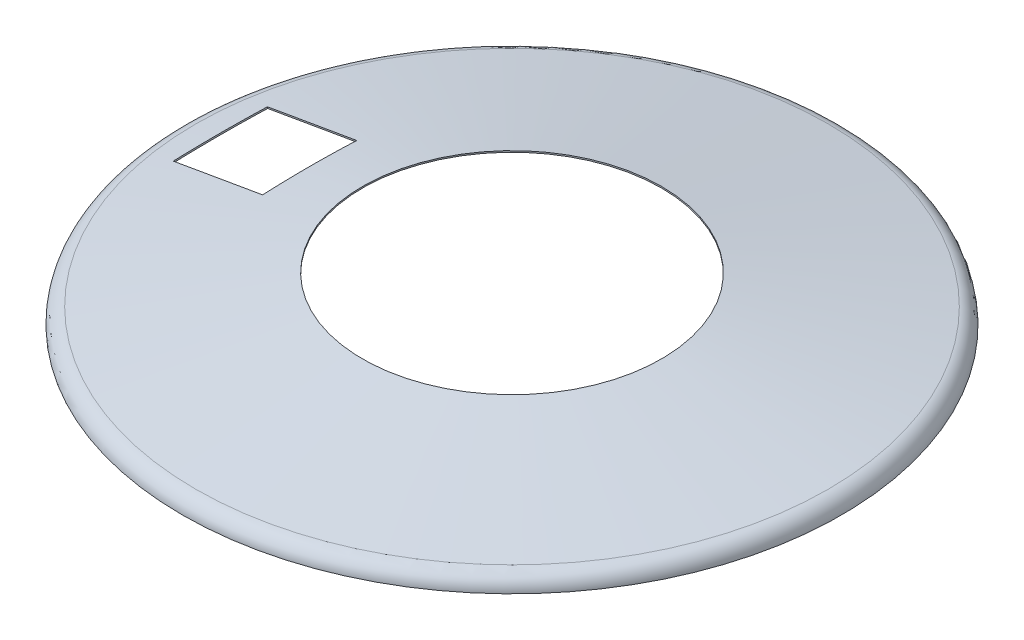
ISO-10303-21;
HEADER;
FILE_DESCRIPTION(('STEP AP214'),'2;1');
FILE_NAME('part.step','',(''),(''),'','','');
FILE_SCHEMA(('AUTOMOTIVE_DESIGN { 1 0 10303 214 1 1 1 1 }'));
ENDSEC;
DATA;
#1=APPLICATION_CONTEXT('core data for automotive mechanical design processes');
#2=APPLICATION_PROTOCOL_DEFINITION('international standard','automotive_design',2000,#1);
#3=PRODUCT_CONTEXT('',#1,'mechanical');
#4=PRODUCT('Part','Part','',(#3));
#5=PRODUCT_RELATED_PRODUCT_CATEGORY('part','',(#4));
#6=PRODUCT_DEFINITION_FORMATION('','',#4);
#7=PRODUCT_DEFINITION_CONTEXT('part definition',#1,'design');
#8=PRODUCT_DEFINITION('design','',#6,#7);
#9=PRODUCT_DEFINITION_SHAPE('','',#8);
#10=(LENGTH_UNIT() NAMED_UNIT(*) SI_UNIT(.MILLI.,.METRE.));
#11=(NAMED_UNIT(*) PLANE_ANGLE_UNIT() SI_UNIT($,.RADIAN.));
#12=(NAMED_UNIT(*) SI_UNIT($,.STERADIAN.) SOLID_ANGLE_UNIT());
#13=UNCERTAINTY_MEASURE_WITH_UNIT(LENGTH_MEASURE(1.E-05),#10,'distance_accuracy_value','');
#14=(GEOMETRIC_REPRESENTATION_CONTEXT(3) GLOBAL_UNCERTAINTY_ASSIGNED_CONTEXT((#13)) GLOBAL_UNIT_ASSIGNED_CONTEXT((#10,
#11,#12)) REPRESENTATION_CONTEXT('',''));
#15=CARTESIAN_POINT('',(0.,0.,0.));
#16=DIRECTION('',(0.,0.,1.));
#17=DIRECTION('',(1.,0.,0.));
#18=AXIS2_PLACEMENT_3D('',#15,#16,#17);
#19=CARTESIAN_POINT('',(-115.932209913367,-471.078681033964,-95.5));
#20=DIRECTION('',(-0.866025403784441,-0.499999999999997,0.));
#21=DIRECTION('',(0.499999999999997,-0.866025403784441,0.));
#22=AXIS2_PLACEMENT_3D('',#19,#20,#21);
#23=PLANE('',#22);
#24=DIRECTION('',(0.,0.,1.));
#25=VECTOR('',#24,1.);
#26=CARTESIAN_POINT('',(-429.331249918757,71.7443792986884,-95.4999999999998));
#27=LINE('',#26,#25);
#28=CARTESIAN_POINT('',(-429.331249918757,71.7443792986884,-95.5));
#29=VERTEX_POINT('',#28);
#30=CARTESIAN_POINT('',(-429.331249918757,71.7443792986879,-82.8285987390821));
#31=VERTEX_POINT('',#30);
#32=EDGE_CURVE('E260',#29,#31,#27,.T.);
#33=ORIENTED_EDGE('',*,*,#32,.F.);
#34=DIRECTION('',(-0.499999999999997,0.866025403784441,0.));
#35=VECTOR('',#34,1.);
#36=CARTESIAN_POINT('',(-115.932209913367,-471.078681033964,-95.5));
#37=LINE('',#36,#35);
#38=CARTESIAN_POINT('',(-429.093038378936,71.331784808768,-95.5));
#39=VERTEX_POINT('',#38);
#40=EDGE_CURVE('E198',#39,#29,#37,.T.);
#41=ORIENTED_EDGE('',*,*,#40,.F.);
#42=CARTESIAN_POINT('',(-429.093034361608,71.3317778505521,95.5002));
#43=CARTESIAN_POINT('',(-429.172938291337,71.4701755165674,91.5223369563016));
#44=CARTESIAN_POINT('',(-429.24804641461,71.6002666021375,87.5440941889164));
#45=CARTESIAN_POINT('',(-429.388542216467,71.8436124692038,79.5869194245034));
#46=CARTESIAN_POINT('',(-429.453929887922,71.9568672383519,75.6079874269721));
#47=CARTESIAN_POINT('',(-429.635318930964,72.2710422768383,63.67026378774));
#48=CARTESIAN_POINT('',(-429.736546172461,72.4463730022201,55.7105523783634));
#49=CARTESIAN_POINT('',(-429.898782990876,72.7273754145727,39.7927774625099));
#50=CARTESIAN_POINT('',(-429.959809103711,72.8330757425914,31.8347146261831));
#51=CARTESIAN_POINT('',(-430.041231391494,72.9741032819,15.9177678587885));
#52=CARTESIAN_POINT('',(-430.061627647684,73.0094306339052,7.95888392939424));
#53=CARTESIAN_POINT('',(-430.061627647684,73.0094306339052,-7.95888392939421));
#54=CARTESIAN_POINT('',(-430.041231391494,72.9741032819,-15.9177678587884));
#55=CARTESIAN_POINT('',(-429.959809103711,72.8330757425914,-31.8347146261831));
#56=CARTESIAN_POINT('',(-429.898782990876,72.7273754145727,-39.7927774625099));
#57=CARTESIAN_POINT('',(-429.736546172461,72.4463730022201,-55.7105523783634));
#58=CARTESIAN_POINT('',(-429.635318930964,72.2710422768383,-63.67026378774));
#59=CARTESIAN_POINT('',(-429.453929887922,71.9568672383519,-75.6079874269721));
#60=CARTESIAN_POINT('',(-429.388542216467,71.8436124692039,-79.5869194245033));
#61=CARTESIAN_POINT('',(-429.24804641461,71.6002666021375,-87.5440941889164));
#62=CARTESIAN_POINT('',(-429.172938291337,71.4701755165674,-91.5223369563015));
#63=CARTESIAN_POINT('',(-429.093034361608,71.3317778505521,-95.5002));
#64=B_SPLINE_CURVE_WITH_KNOTS('',3,(#42,#43,#44,#45,#46,#47,#48,#49,#50,#51,#52,#53,#54,#55,#56,
#57,#58,#59,#60,#61,#62,#63),.UNSPECIFIED.,.F.,.F.,(4,2,2,2,2,2,2,2,2,2,4),(0.,11.9431919910017,
23.8863927413458,47.7728178970725,71.6494117124264,95.525957784919,119.402503857412,
143.279097672766,167.165522828492,179.108723578836,191.051915569838),.UNSPECIFIED.);
#65=EDGE_CURVE('E224',#31,#39,#64,.T.);
#66=ORIENTED_EDGE('',*,*,#65,.F.);
#67=EDGE_LOOP('',(#33,#41,#66));
#68=FACE_BOUND('',#67,.T.);
#69=ADVANCED_FACE('F51',(#68),#23,.T.);
#70=CARTESIAN_POINT('',(0.,150.,0.));
#71=DIRECTION('',(0.,-1.,0.));
#72=DIRECTION('',(0.,0.,-1.));
#73=AXIS2_PLACEMENT_3D('',#70,#71,#72);
#74=CONICAL_SURFACE('',#73,9.99999999999999,1.39654914535002);
#75=CARTESIAN_POINT('',(-950.370325256532,-16.4591906197073,99.9999999999998));
#76=CARTESIAN_POINT('',(-935.523594358654,-13.8600421184706,99.9999999999997));
#77=CARTESIAN_POINT('',(-920.67675268677,-11.2615262310917,99.9999999999997));
#78=CARTESIAN_POINT('',(-890.982807568639,-6.06599029186537,99.9999999999997));
#79=CARTESIAN_POINT('',(-876.135704122393,-3.46897024002299,99.9999999999997));
#80=CARTESIAN_POINT('',(-846.441205444463,1.72334163407172,99.9999999999997));
#81=CARTESIAN_POINT('',(-831.593810212985,4.3186334575,99.9999999999997));
#82=CARTESIAN_POINT('',(-801.898666345928,9.50719470137558,99.9999999999997));
#83=CARTESIAN_POINT('',(-787.050917710349,12.1004641218202,99.9999999999997));
#84=CARTESIAN_POINT('',(-757.355070604999,17.2846059152811,99.9999999999997));
#85=CARTESIAN_POINT('',(-742.506972137096,19.8754782990004,99.9999999999997));
#86=CARTESIAN_POINT('',(-712.810279689154,25.0543816669291,99.9999999999997));
#87=CARTESIAN_POINT('',(-697.961685709116,27.6424126511463,99.9999999999997));
#88=CARTESIAN_POINT('',(-668.263890978151,32.815056165516,99.9999999999997));
#89=CARTESIAN_POINT('',(-653.414690226783,35.3996686931406,99.9999999999997));
#90=CARTESIAN_POINT('',(-623.715564140523,40.5647270119882,99.9999999999997));
#91=CARTESIAN_POINT('',(-608.865638805639,43.1451728032517,99.9999999999997));
#92=CARTESIAN_POINT('',(-579.164786980389,48.3009376619514,99.9999999999997));
#93=CARTESIAN_POINT('',(-564.313860483537,50.8762566920242,99.9999999999997));
#94=CARTESIAN_POINT('',(-534.610891259595,56.0204429856048,99.9999999999997));
#95=CARTESIAN_POINT('',(-519.758848532608,58.5893102496992,99.9999999999997));
#96=CARTESIAN_POINT('',(-490.053366275933,63.7187998953491,99.9999999999997));
#97=CARTESIAN_POINT('',(-475.199926748776,66.2794222915534,99.9999999999997));
#98=CARTESIAN_POINT('',(-445.491196913222,71.3899455324338,99.9999999999997));
#99=CARTESIAN_POINT('',(-430.635906604184,73.9398463733878,99.9999999999997));
#100=CARTESIAN_POINT('',(-408.351074172993,77.7539204184719,99.9999999999997));
#101=CARTESIAN_POINT('',(-400.922455031503,79.0234865702625,99.9999999999997));
#102=CARTESIAN_POINT('',(-386.064496092451,81.5583946610527,99.9999999999997));
#103=CARTESIAN_POINT('',(-378.635156294909,82.8237366001622,99.9999999999997));
#104=CARTESIAN_POINT('',(-363.77563888018,85.3494490384255,99.9999999999997));
#105=CARTESIAN_POINT('',(-356.345461263806,86.6098195423671,99.9999999999997));
#106=CARTESIAN_POINT('',(-341.484105195661,89.1246527737558,99.9999999999997));
#107=CARTESIAN_POINT('',(-334.052926743783,90.3791155005783,99.9999999999997));
#108=CARTESIAN_POINT('',(-319.189330088498,92.8809584854959,99.9999999999997));
#109=CARTESIAN_POINT('',(-311.756911877702,94.1283386997053,99.9999999999997));
#110=CARTESIAN_POINT('',(-296.890639441912,96.614504410786,99.9999999999997));
#111=CARTESIAN_POINT('',(-289.456785217367,97.8532899103432,99.9999999999997));
#112=CARTESIAN_POINT('',(-278.304676790716,99.7035447773387,99.9999999999997));
#113=CARTESIAN_POINT('',(-274.587079913374,100.318976858855,99.9999999999997));
#114=CARTESIAN_POINT('',(-267.151399074549,101.546890636013,99.9999999999997));
#115=CARTESIAN_POINT('',(-263.433315113097,102.159372331847,99.9999999999997));
#116=CARTESIAN_POINT('',(-255.996602576377,103.38104572185,99.9999999999997));
#117=CARTESIAN_POINT('',(-252.277974000545,103.990237412586,99.9999999999997));
#118=CARTESIAN_POINT('',(-244.840111078716,105.204916435165,99.9999999999997));
#119=CARTESIAN_POINT('',(-241.120876732579,105.810403766154,99.9999999999997));
#120=CARTESIAN_POINT('',(-237.40130784213,106.413831920006,99.9999999999997));
#121=B_SPLINE_CURVE_WITH_KNOTS('',3,(#75,#76,#77,#78,#79,#80,#81,#82,#83,#84,#85,#86,#87,#88,
#89,#90,#91,#92,#93,#94,#95,#96,#97,#98,#99,#100,#101,#102,#103,#104,#105,#106,#107,#108,#109,
#110,#111,#112,#113,#114,#115,#116,#117,#118,#119,#120),.UNSPECIFIED.,.F.,.F.,(4,2,2,2,2,2,2,2,
2,2,2,2,2,2,2,2,2,2,2,2,2,2,4),(0.,45.2175731732453,90.4351465022107,135.65268903182,
180.870231620516,226.087571321884,271.304910897883,316.522283892614,361.73965644702,
406.957357343216,452.175054127646,497.392670528604,542.610302626311,565.219273893365,
587.828244571841,610.437193471716,633.04614476215,655.655235992778,678.264320157314,
689.568900061745,700.873479223093,712.178070177561,723.482663740328),.UNSPECIFIED.);
#122=CARTESIAN_POINT('',(-619.532326658648,41.2910288354882,99.9999999999997));
#123=VERTEX_POINT('',#122);
#124=CARTESIAN_POINT('',(-429.744212308655,74.0903250776291,99.9999999999998));
#125=VERTEX_POINT('',#124);
#126=EDGE_CURVE('E137',#123,#125,#121,.T.);
#127=ORIENTED_EDGE('',*,*,#126,.F.);
#128=CARTESIAN_POINT('',(-619.532325700396,41.2910233918736,-100.0002));
#129=CARTESIAN_POINT('',(-619.572254470877,41.5178496909786,-91.6681660032065));
#130=CARTESIAN_POINT('',(-619.607301655845,41.7169448087163,-83.3353480656244));
#131=CARTESIAN_POINT('',(-619.667505680389,42.058950232721,-66.6685140375956));
#132=CARTESIAN_POINT('',(-619.692662507704,42.2018604693314,-58.3344979456762));
#133=CARTESIAN_POINT('',(-619.732954648105,42.4307509906246,-41.667269137553));
#134=CARTESIAN_POINT('',(-619.748091897524,42.5167422751755,-33.3340565774838));
#135=CARTESIAN_POINT('',(-619.768283220978,42.6314446093051,-16.6672293447888));
#136=CARTESIAN_POINT('',(-619.77333730075,42.660155691467,-8.33361467239445));
#137=CARTESIAN_POINT('',(-619.77333730075,42.660155691467,8.33361467239421));
#138=CARTESIAN_POINT('',(-619.768283220978,42.6314446093051,16.6672293447886));
#139=CARTESIAN_POINT('',(-619.748091897524,42.5167422751755,33.3340565774835));
#140=CARTESIAN_POINT('',(-619.732954648105,42.4307509906246,41.6672691375527));
#141=CARTESIAN_POINT('',(-619.692662507704,42.2018604693313,58.334497945676));
#142=CARTESIAN_POINT('',(-619.667505680389,42.058950232721,66.6685140375954));
#143=CARTESIAN_POINT('',(-619.607301655845,41.7169448087163,83.3353480656242));
#144=CARTESIAN_POINT('',(-619.572254470877,41.5178496909786,91.6681660032062));
#145=CARTESIAN_POINT('',(-619.532325700396,41.2910233918736,100.0002));
#146=B_SPLINE_CURVE_WITH_KNOTS('',3,(#128,#129,#130,#131,#132,#133,#134,#135,#136,#137,#138,
#139,#140,#141,#142,#143,#144,#145),.UNSPECIFIED.,.F.,.F.,(4,2,2,2,2,2,2,2,4),(0.,
25.0056104066725,50.0112518145787,75.0120593470569,100.012852658073,125.013645969089,
150.014453501567,175.020094909473,200.025705316146),.UNSPECIFIED.);
#147=CARTESIAN_POINT('',(-619.532326658648,41.2910288354881,-100.));
#148=VERTEX_POINT('',#147);
#149=EDGE_CURVE('E71',#148,#123,#146,.T.);
#150=ORIENTED_EDGE('',*,*,#149,.F.);
#151=CARTESIAN_POINT('',(-237.40130784213,106.413831920006,-100.));
#152=CARTESIAN_POINT('',(-242.739375542503,105.547803955144,-100.));
#153=CARTESIAN_POINT('',(-248.076760557433,104.677579132615,-100.));
#154=CARTESIAN_POINT('',(-258.750338276316,102.929864226002,-100.));
#155=CARTESIAN_POINT('',(-264.086530980908,102.05237414582,-100.));
#156=CARTESIAN_POINT('',(-274.75789221902,100.291258003178,-100.));
#157=CARTESIAN_POINT('',(-280.093060754565,99.4076319529752,-100.));
#158=CARTESIAN_POINT('',(-290.762520920713,97.6350980357732,-100.));
#159=CARTESIAN_POINT('',(-296.096812551181,96.7461901679578,-100.));
#160=CARTESIAN_POINT('',(-312.098500049394,94.0726729138723,-100.));
#161=CARTESIAN_POINT('',(-322.764759524678,92.2812614450178,-100.));
#162=CARTESIAN_POINT('',(-344.094967595146,88.6847089671003,-100.));
#163=CARTESIAN_POINT('',(-354.758916188943,86.8795679498211,-100.));
#164=CARTESIAN_POINT('',(-376.084928978274,83.2586320639311,-100.));
#165=CARTESIAN_POINT('',(-386.746993186167,81.4428372680832,-100.));
#166=CARTESIAN_POINT('',(-408.06968031832,77.8028215376579,-100.));
#167=CARTESIAN_POINT('',(-418.730303242878,75.9786006048244,-100.));
#168=CARTESIAN_POINT('',(-440.050400473227,72.323386935144,-100.));
#169=CARTESIAN_POINT('',(-450.709874777676,70.4923941904832,-100.));
#170=CARTESIAN_POINT('',(-472.027874942412,66.8248944125679,-100.));
#171=CARTESIAN_POINT('',(-482.686400802662,64.9883873791087,-100.));
#172=CARTESIAN_POINT('',(-501.734575741535,61.7021211155233,-100.));
#173=CARTESIAN_POINT('',(-510.124374198799,60.2532275448342,-100.));
#174=CARTESIAN_POINT('',(-526.903545661544,57.3529944552242,-100.));
#175=CARTESIAN_POINT('',(-535.292918667155,55.9016549370556,-100.));
#176=CARTESIAN_POINT('',(-552.071306373218,52.996842636189,-100.));
#177=CARTESIAN_POINT('',(-560.460321073199,51.5433698507653,-100.));
#178=CARTESIAN_POINT('',(-577.238027022341,48.6345540456257,-100.));
#179=CARTESIAN_POINT('',(-585.626718271472,47.1792110257321,-100.));
#180=CARTESIAN_POINT('',(-608.865698021583,43.1451648092799,-100.));
#181=CARTESIAN_POINT('',(-623.715681973158,40.5647071488846,-100.));
#182=CARTESIAN_POINT('',(-653.414925640985,35.3996271221068,-100.));
#183=CARTESIAN_POINT('',(-668.264185357228,32.8150047556743,-99.9999999999999));
#184=CARTESIAN_POINT('',(-697.962109271412,27.6423390128333,-99.9999999999999));
#185=CARTESIAN_POINT('',(-712.810773469337,25.0542956363399,-99.9999999999999));
#186=CARTESIAN_POINT('',(-742.507606374732,19.8753676108863,-99.9999999999999));
#187=CARTESIAN_POINT('',(-757.355775082201,17.2844829619177,-99.9999999999999));
#188=CARTESIAN_POINT('',(-787.051633916877,12.1003390585649,-99.9999999999999));
#189=CARTESIAN_POINT('',(-801.899324045826,9.50707981416077,-99.9999999999999));
#190=CARTESIAN_POINT('',(-831.594350961211,4.31853894276885,-99.9999999999999));
#191=CARTESIAN_POINT('',(-846.441687747647,1.72325731577604,-99.9999999999999));
#192=CARTESIAN_POINT('',(-876.136057364412,-3.46903202327144,-99.9999999999999));
#193=CARTESIAN_POINT('',(-890.983090194783,-6.06603973508652,-99.9999999999999));
#194=CARTESIAN_POINT('',(-920.676894026541,-11.2615509689308,-99.9999999999999));
#195=CARTESIAN_POINT('',(-935.523665027931,-13.8600544909492,-99.9999999999999));
#196=CARTESIAN_POINT('',(-950.370325256532,-16.4591906197073,-99.9999999999999));
#197=B_SPLINE_CURVE_WITH_KNOTS('',3,(#151,#152,#153,#154,#155,#156,#157,#158,#159,#160,#161,
#162,#163,#164,#165,#166,#167,#168,#169,#170,#171,#172,#173,#174,#175,#176,#177,#178,#179,#180,
#181,#182,#183,#184,#185,#186,#187,#188,#189,#190,#191,#192,#193,#194,#195,#196),.UNSPECIFIED.,
.F.,.F.,(4,2,2,2,2,2,2,2,2,2,2,2,2,2,2,2,2,2,2,2,2,2,4),(0.,16.2235816898107,32.4471546646425,
48.6706952432483,64.8942383297104,97.3411694236918,129.788119936423,162.234849100878,
194.681571550733,227.128331452256,259.575092558265,285.117059538039,310.659018663835,
336.201010455304,361.743004676476,406.96055648815,452.17810884393,497.395662321663,
542.613215932092,587.830580365354,633.047944911645,678.265303182682,723.482661123493),.UNSPECIFIED.);
#198=CARTESIAN_POINT('',(-429.744212308655,74.090325077629,-100.));
#199=VERTEX_POINT('',#198);
#200=EDGE_CURVE('E174',#199,#148,#197,.T.);
#201=ORIENTED_EDGE('',*,*,#200,.F.);
#202=CARTESIAN_POINT('',(-429.744210945199,74.0903173321441,100.0002));
#203=CARTESIAN_POINT('',(-429.772608548535,74.2516376831171,95.8348405333095));
#204=CARTESIAN_POINT('',(-429.799318082273,74.4033684931484,91.6690969987999));
#205=CARTESIAN_POINT('',(-429.849305562918,74.6873360458541,83.3369215932543));
#206=CARTESIAN_POINT('',(-429.872583506841,74.8195727715812,79.1704897216229));
#207=CARTESIAN_POINT('',(-429.915652419914,75.064237509335,70.8370035415221));
#208=CARTESIAN_POINT('',(-429.93544337137,75.1766654208487,66.6699492300015));
#209=CARTESIAN_POINT('',(-429.971492169977,75.3814504787528,58.3353369615978));
#210=CARTESIAN_POINT('',(-429.987750018048,75.4738076303731,54.1677790048461));
#211=CARTESIAN_POINT('',(-430.031151006503,75.720358813137,41.6677909259166));
#212=CARTESIAN_POINT('',(-430.052938854821,75.8441306433233,33.3347188918748));
#213=CARTESIAN_POINT('',(-430.082012976968,76.0092941443925,16.6677645705605));
#214=CARTESIAN_POINT('',(-430.089299285589,76.0506860129314,8.33388228528021));
#215=CARTESIAN_POINT('',(-430.089299285589,76.0506860129314,-8.33388228528047));
#216=CARTESIAN_POINT('',(-430.082012976968,76.0092941443925,-16.6677645705608));
#217=CARTESIAN_POINT('',(-430.052938854821,75.8441306433233,-33.334718891875));
#218=CARTESIAN_POINT('',(-430.031151006503,75.720358813137,-41.6677909259169));
#219=CARTESIAN_POINT('',(-429.987750018048,75.4738076303731,-54.1677790048464));
#220=CARTESIAN_POINT('',(-429.971492169977,75.3814504787528,-58.335336961598));
#221=CARTESIAN_POINT('',(-429.93544337137,75.1766654208487,-66.6699492300017));
#222=CARTESIAN_POINT('',(-429.915652419914,75.064237509335,-70.8370035415223));
#223=CARTESIAN_POINT('',(-429.872583506841,74.8195727715811,-79.1704897216232));
#224=CARTESIAN_POINT('',(-429.849305562918,74.6873360458541,-83.3369215932545));
#225=CARTESIAN_POINT('',(-429.799318082273,74.4033684931484,-91.6690969988002));
#226=CARTESIAN_POINT('',(-429.772608548535,74.2516376831171,-95.8348405333097));
#227=CARTESIAN_POINT('',(-429.744210945199,74.090317332144,-100.0002));
#228=B_SPLINE_CURVE_WITH_KNOTS('',3,(#202,#203,#204,#205,#206,#207,#208,#209,#210,#211,#212,
#213,#214,#215,#216,#217,#218,#219,#220,#221,#222,#223,#224,#225,#226,#227),.UNSPECIFIED.,.F.,
.F.,(4,2,2,2,2,2,2,2,2,2,2,2,4),(0.,12.5057268127826,25.0114644974725,37.5172656364541,
50.0230635167302,75.0246721337525,100.026220763831,125.027769393909,150.029378010931,
162.535175891207,175.040977030189,187.546714714879,200.052441527661),.UNSPECIFIED.);
#229=EDGE_CURVE('E175',#125,#199,#228,.T.);
#230=ORIENTED_EDGE('',*,*,#229,.F.);
#231=EDGE_LOOP('',(#127,#150,#201,#230));
#232=FACE_BOUND('',#231,.T.);
#233=CARTESIAN_POINT('',(0.,33.4851492774349,0.));
#234=DIRECTION('',(0.,1.,0.));
#235=DIRECTION('',(0.,0.,1.));
#236=AXIS2_PLACEMENT_3D('',#233,#234,#235);
#237=CIRCLE('',#236,671.89447010917);
#238=CARTESIAN_POINT('',(0.,33.4851492774349,671.89447010917));
#239=VERTEX_POINT('',#238);
#240=EDGE_CURVE('E214',#239,#239,#237,.T.);
#241=ORIENTED_EDGE('',*,*,#240,.T.);
#242=EDGE_LOOP('',(#241));
#243=FACE_BOUND('',#242,.T.);
#244=CARTESIAN_POINT('',(0.,95.8700469407466,0.));
#245=DIRECTION('',(0.,-1.,0.));
#246=DIRECTION('',(0.,0.,-1.));
#247=AXIS2_PLACEMENT_3D('',#244,#245,#246);
#248=CIRCLE('',#247,317.5);
#249=CARTESIAN_POINT('',(0.,95.8700469407466,-317.5));
#250=VERTEX_POINT('',#249);
#251=EDGE_CURVE('E202',#250,#250,#248,.T.);
#252=ORIENTED_EDGE('',*,*,#251,.T.);
#253=EDGE_LOOP('',(#252));
#254=FACE_BOUND('',#253,.T.);
#255=ADVANCED_FACE('F184',(#232,#243,#254),#74,.T.);
#256=CARTESIAN_POINT('',(0.,30.5305772823671,0.));
#257=DIRECTION('',(0.,-1.,0.));
#258=DIRECTION('',(0.,0.,-1.));
#259=AXIS2_PLACEMENT_3D('',#256,#257,#258);
#260=CONICAL_SURFACE('',#259,671.374369805419,1.39654914535002);
#261=CARTESIAN_POINT('',(-429.223703070959,71.1334300214584,-100.0002));
#262=CARTESIAN_POINT('',(-429.252133372896,71.2949361257775,-95.8348435034772));
#263=CARTESIAN_POINT('',(-429.278873862856,71.44684279109,-91.6691020960138));
#264=CARTESIAN_POINT('',(-429.328919581645,71.7311411814969,-83.3369293965169));
#265=CARTESIAN_POINT('',(-429.352224807473,71.8635328895478,-79.1704981038841));
#266=CARTESIAN_POINT('',(-429.395344420879,72.1084856444086,-70.8370116050717));
#267=CARTESIAN_POINT('',(-429.41515879066,72.2210465901174,-66.6699563958196));
#268=CARTESIAN_POINT('',(-429.451250400748,72.4260748503505,-58.3353411615456));
#269=CARTESIAN_POINT('',(-429.467527641982,72.5185421701348,-54.167781136656));
#270=CARTESIAN_POINT('',(-429.510980514146,72.7653880925011,-41.6677932013414));
#271=CARTESIAN_POINT('',(-429.532794618568,72.8893090776577,-33.3347218608533));
#272=CARTESIAN_POINT('',(-429.561903834913,73.0546719409224,-16.6677670122393));
#273=CARTESIAN_POINT('',(-429.569198981839,73.0961140178636,-8.3338835061197));
#274=CARTESIAN_POINT('',(-429.569198981839,73.0961140178636,8.33388350611944));
#275=CARTESIAN_POINT('',(-429.561903834913,73.0546719409224,16.667767012239));
#276=CARTESIAN_POINT('',(-429.532794618568,72.8893090776577,33.3347218608531));
#277=CARTESIAN_POINT('',(-429.510980514146,72.7653880925011,41.6677932013412));
#278=CARTESIAN_POINT('',(-429.467527641982,72.5185421701348,54.1677811366558));
#279=CARTESIAN_POINT('',(-429.451250400748,72.4260748503505,58.3353411615453));
#280=CARTESIAN_POINT('',(-429.41515879066,72.2210465901174,66.6699563958194));
#281=CARTESIAN_POINT('',(-429.395344420879,72.1084856444086,70.8370116050714));
#282=CARTESIAN_POINT('',(-429.352224807473,71.8635328895478,79.1704981038839));
#283=CARTESIAN_POINT('',(-429.328919581645,71.7311411814969,83.3369293965167));
#284=CARTESIAN_POINT('',(-429.278873862856,71.44684279109,91.6691020960136));
#285=CARTESIAN_POINT('',(-429.252133372896,71.2949361257775,95.834843503477));
#286=CARTESIAN_POINT('',(-429.223703070959,71.1334300214584,100.0002));
#287=B_SPLINE_CURVE_WITH_KNOTS('',3,(#261,#262,#263,#264,#265,#266,#267,#268,#269,#270,#271,
#272,#273,#274,#275,#276,#277,#278,#279,#280,#281,#282,#283,#284,#285,#286),.UNSPECIFIED.,.F.,
.F.,(4,2,2,2,2,2,2,2,2,2,2,2,4),(0.,12.5057401407789,25.0114912034295,37.5173060209823,
50.0231175648984,75.0247298913602,100.026281945994,125.027834000628,150.02944632709,
162.535257871006,175.041072688559,187.546823751209,200.052563891988),.UNSPECIFIED.);
#288=CARTESIAN_POINT('',(-429.331249918757,71.7443792986884,82.8285987390692));
#289=VERTEX_POINT('',#288);
#290=EDGE_CURVE('E130',#31,#289,#287,.T.);
#291=ORIENTED_EDGE('',*,*,#290,.F.);
#292=ORIENTED_EDGE('',*,*,#65,.T.);
#293=CARTESIAN_POINT('',(-429.093042401508,71.3317917660673,-95.4998));
#294=CARTESIAN_POINT('',(-429.090882834182,71.3280918818563,-95.6062530106255));
#295=CARTESIAN_POINT('',(-429.093213521804,71.3236114089377,-95.7127680175787));
#296=CARTESIAN_POINT('',(-429.106789347104,71.3131315889643,-95.9251425643384));
#297=CARTESIAN_POINT('',(-429.118033575694,71.3071323968457,-96.0310021698794));
#298=CARTESIAN_POINT('',(-429.149339033494,71.2936699907812,-96.2411005922542));
#299=CARTESIAN_POINT('',(-429.169382787641,71.2862096946387,-96.3453421996192));
#300=CARTESIAN_POINT('',(-429.21810711648,71.2698779915895,-96.5516702893277));
#301=CARTESIAN_POINT('',(-429.246787625288,71.2610065954476,-96.6537567881051));
#302=CARTESIAN_POINT('',(-429.312541952013,71.2419233373269,-96.8550665467613));
#303=CARTESIAN_POINT('',(-429.349615766349,71.23171147592,-96.9542898078617));
#304=CARTESIAN_POINT('',(-429.43182535513,71.2100315254493,-97.1492088310128));
#305=CARTESIAN_POINT('',(-429.476964113677,71.1985629720077,-97.2449032715033));
#306=CARTESIAN_POINT('',(-429.623902553767,71.1624134572186,-97.5256651280257));
#307=CARTESIAN_POINT('',(-429.73728819102,71.1359701819482,-97.7046048151635));
#308=CARTESIAN_POINT('',(-429.99323276657,71.0787675163658,-98.0442317650612));
#309=CARTESIAN_POINT('',(-430.136262070109,71.0479414250413,-98.204550090927));
#310=CARTESIAN_POINT('',(-430.445810803585,70.9832341554138,-98.4999442987981));
#311=CARTESIAN_POINT('',(-430.612337865448,70.9493519858106,-98.6350119462706));
#312=CARTESIAN_POINT('',(-430.973490260208,70.8776004126091,-98.8837652630727));
#313=CARTESIAN_POINT('',(-431.16913987978,70.8396147546289,-98.9959284804116));
#314=CARTESIAN_POINT('',(-431.575619547833,70.7623299210706,-99.1874398547074));
#315=CARTESIAN_POINT('',(-431.78645287647,70.7230304626589,-99.2667808959261));
#316=CARTESIAN_POINT('',(-432.231063893699,70.6416830851048,-99.3953563558042));
#317=CARTESIAN_POINT('',(-432.465456308925,70.5996140126238,-99.4424538141872));
#318=CARTESIAN_POINT('',(-432.938928930826,70.5161984856129,-99.4979242183018));
#319=CARTESIAN_POINT('',(-433.178010485137,70.4748522454749,-99.5062858628077));
#320=CARTESIAN_POINT('',(-433.665418661137,70.392108503548,-99.4839240559806));
#321=CARTESIAN_POINT('',(-433.913677817328,70.3507922276727,-99.4514269441589));
#322=CARTESIAN_POINT('',(-434.401849343518,70.2712056519568,-99.3450224363428));
#323=CARTESIAN_POINT('',(-434.641760680768,70.2329357282464,-99.271109935858));
#324=CARTESIAN_POINT('',(-434.99089591564,70.1785346522063,-99.1300936545402));
#325=CARTESIAN_POINT('',(-435.106023843065,70.1608221876163,-99.0777311963423));
#326=CARTESIAN_POINT('',(-435.331453766437,70.1266015409764,-98.9631818702871));
#327=CARTESIAN_POINT('',(-435.441757700062,70.1100928735793,-98.9009989941991));
#328=CARTESIAN_POINT('',(-435.656682585094,70.0784121028233,-98.7671259541722));
#329=CARTESIAN_POINT('',(-435.761301753106,70.0632404179779,-98.6954328307254));
#330=CARTESIAN_POINT('',(-435.963883402847,70.0343802449068,-98.5430020726958));
#331=CARTESIAN_POINT('',(-436.06184891365,70.0206910800541,-98.4622685986699));
#332=CARTESIAN_POINT('',(-436.247121396414,69.9953520816023,-98.2950758560763));
#333=CARTESIAN_POINT('',(-436.334675139575,69.9836493883589,-98.2088980608067));
#334=CARTESIAN_POINT('',(-436.501930212357,69.9618662932622,-98.029110232856));
#335=CARTESIAN_POINT('',(-436.581635190949,69.9517851361462,-97.9355036907799));
#336=CARTESIAN_POINT('',(-436.732495408167,69.9333421130947,-97.741397867899));
#337=CARTESIAN_POINT('',(-436.80364635532,69.9249811086593,-97.6408951667443));
#338=CARTESIAN_POINT('',(-436.936575307978,69.910087035927,-97.4338039509916));
#339=CARTESIAN_POINT('',(-436.998357912081,69.9035530694617,-97.3272184578229));
#340=CARTESIAN_POINT('',(-437.108446081176,69.8927332081061,-97.1153815803153));
#341=CARTESIAN_POINT('',(-437.157342461456,69.8883348330748,-97.0104426994798));
#342=CARTESIAN_POINT('',(-437.245758852989,69.8812820694361,-96.7966823252726));
#343=CARTESIAN_POINT('',(-437.285283433259,69.8786268298795,-96.6878627537399));
#344=CARTESIAN_POINT('',(-437.354488900979,69.8751037398229,-96.4672981985222));
#345=CARTESIAN_POINT('',(-437.384185183043,69.8742330828139,-96.3555580885508));
#346=CARTESIAN_POINT('',(-437.433454258646,69.8742980630186,-96.1299195644428));
#347=CARTESIAN_POINT('',(-437.453033049175,69.8752326286535,-96.0160224704287));
#348=CARTESIAN_POINT('',(-437.475825863018,69.8781440982588,-95.8348118788641));
#349=CARTESIAN_POINT('',(-437.482459470534,69.8795229843473,-95.7679011345237));
#350=CARTESIAN_POINT('',(-437.49218180626,69.8828904640051,-95.6339381482829));
#351=CARTESIAN_POINT('',(-437.495275793969,69.88487814738,-95.5668862650235));
#352=CARTESIAN_POINT('',(-437.496593913983,69.8871699696963,-95.4998));
#353=B_SPLINE_CURVE_WITH_KNOTS('',3,(#293,#294,#295,#296,#297,#298,#299,#300,#301,#302,#303,
#304,#305,#306,#307,#308,#309,#310,#311,#312,#313,#314,#315,#316,#317,#318,#319,#320,#321,#322,
#323,#324,#325,#326,#327,#328,#329,#330,#331,#332,#333,#334,#335,#336,#337,#338,#339,#340,#341,
#342,#343,#344,#345,#346,#347,#348,#349,#350,#351,#352),.UNSPECIFIED.,.F.,.F.,(4,2,2,2,2,2,2,2,
2,2,2,2,2,2,2,2,2,2,2,2,2,2,2,2,2,2,2,2,2,4),(0.,0.319518543528199,0.639004503664969,
0.957858843440491,1.27671075090581,1.59556252232659,1.91453251699085,2.55186567481165,
3.20021465925397,3.84877471023602,4.53188633829277,5.21514598515572,5.94017423372464,
6.66541399694325,7.4232512978138,8.18118202348577,8.56392301069365,8.94650882120533,
9.32921396968827,9.71174370763733,10.0814911481432,10.4510658695532,10.8208252360296,
11.1904025086605,11.5375219117511,11.8844717347416,12.2308755099944,12.5770737234236,
12.778745390048,12.9801170032176),.UNSPECIFIED.);
#354=CARTESIAN_POINT('',(-429.246225862378,71.2613768968952,-96.6466324301243));
#355=VERTEX_POINT('',#354);
#356=EDGE_CURVE('E147',#39,#355,#353,.T.);
#357=ORIENTED_EDGE('',*,*,#356,.T.);
#358=CARTESIAN_POINT('',(-429.223704435986,71.133437775867,-100.));
#359=VERTEX_POINT('',#358);
#360=EDGE_CURVE('E132',#359,#355,#287,.T.);
#361=ORIENTED_EDGE('',*,*,#360,.F.);
#362=CARTESIAN_POINT('',(-949.85710081962,-19.4154692720733,-99.9999999999999));
#363=CARTESIAN_POINT('',(-935.010367009732,-16.8163356651786,-99.9999999999999));
#364=CARTESIAN_POINT('',(-920.163522251642,-14.2178356703565,-99.9999999999999));
#365=CARTESIAN_POINT('',(-890.469570522002,-9.02233403621143,-99.9999999999999));
#366=CARTESIAN_POINT('',(-875.62246355045,-6.42533239689359,-99.9999999999999));
#367=CARTESIAN_POINT('',(-845.927957381521,-1.23306040697644,-99.9999999999999));
#368=CARTESIAN_POINT('',(-831.080558184352,1.36220994481131,-99.9999999999999));
#369=CARTESIAN_POINT('',(-801.385405732431,6.55072448873829,-99.9999999999999));
#370=CARTESIAN_POINT('',(-786.537652477678,9.14396868087482,-99.9999999999999));
#371=CARTESIAN_POINT('',(-756.841795763725,14.3280552631796,-99.9999999999999));
#372=CARTESIAN_POINT('',(-741.993692306408,16.9188976641431,-99.9999999999999));
#373=CARTESIAN_POINT('',(-712.296988857249,22.0977351664871,-99.9999999999999));
#374=CARTESIAN_POINT('',(-697.448388865406,24.6857302678755,-99.9999999999999));
#375=CARTESIAN_POINT('',(-667.750580714245,29.8582944864209,-99.9999999999999));
#376=CARTESIAN_POINT('',(-652.901372554481,32.4428636010233,-100.));
#377=CARTESIAN_POINT('',(-623.202229960819,37.6078252905777,-100.));
#378=CARTESIAN_POINT('',(-608.352295526928,40.1882178655704,-100.));
#379=CARTESIAN_POINT('',(-578.651422481626,45.3438634636966,-100.));
#380=CARTESIAN_POINT('',(-563.800483863666,47.9191164490975,-100.));
#381=CARTESIAN_POINT('',(-534.097487414616,53.0631531637387,-100.));
#382=CARTESIAN_POINT('',(-519.24542958363,55.6319368935732,-100.));
#383=CARTESIAN_POINT('',(-489.539913222887,60.7612352580544,-100.));
#384=CARTESIAN_POINT('',(-474.686454695689,63.3217499075183,-100.));
#385=CARTESIAN_POINT('',(-444.977681012987,68.4320234809399,-100.));
#386=CARTESIAN_POINT('',(-430.122365856833,70.9817824011262,-100.));
#387=CARTESIAN_POINT('',(-407.837489412091,74.7956058331944,-100.));
#388=CARTESIAN_POINT('',(-400.408854276288,76.0650821921965,-100.));
#389=CARTESIAN_POINT('',(-385.550860746276,78.599795102378,-100.));
#390=CARTESIAN_POINT('',(-378.121502352086,79.865031653669,-100.));
#391=CARTESIAN_POINT('',(-363.26194461311,82.3905140027601,-100.));
#392=CARTESIAN_POINT('',(-355.831745269149,83.6507598054146,-100.));
#393=CARTESIAN_POINT('',(-340.970341750559,86.165319431943,-100.));
#394=CARTESIAN_POINT('',(-333.539137575824,87.4196332551824,-100.));
#395=CARTESIAN_POINT('',(-318.675484060053,89.9211477790908,-100.));
#396=CARTESIAN_POINT('',(-311.243034711532,91.1683484352983,-100.));
#397=CARTESIAN_POINT('',(-296.376693654418,93.6541155672365,-100.));
#398=CARTESIAN_POINT('',(-288.94280194628,94.8926820456955,-100.));
#399=CARTESIAN_POINT('',(-277.790631016848,96.7425696817831,-100.));
#400=CARTESIAN_POINT('',(-274.073012196553,97.3578729131345,-100.));
#401=CARTESIAN_POINT('',(-266.637285124768,98.5855140896431,-100.));
#402=CARTESIAN_POINT('',(-262.919176873311,99.1978520349977,-100.));
#403=CARTESIAN_POINT('',(-255.482413034142,100.41922078644,-100.));
#404=CARTESIAN_POINT('',(-251.763757445857,101.028251589038,-100.));
#405=CARTESIAN_POINT('',(-244.325837401652,102.242588850882,-100.));
#406=CARTESIAN_POINT('',(-240.606572945589,102.847895309259,-100.));
#407=CARTESIAN_POINT('',(-236.886972197547,103.451131176722,-100.));
#408=B_SPLINE_CURVE_WITH_KNOTS('',3,(#362,#363,#364,#365,#366,#367,#368,#369,#370,#371,#372,
#373,#374,#375,#376,#377,#378,#379,#380,#381,#382,#383,#384,#385,#386,#387,#388,#389,#390,#391,
#392,#393,#394,#395,#396,#397,#398,#399,#400,#401,#402,#403,#404,#405,#406,#407),.UNSPECIFIED.,
.F.,.F.,(4,2,2,2,2,2,2,2,2,2,2,2,2,2,2,2,2,2,2,2,2,2,4),(0.,45.2175740732646,90.4351483022148,
135.652691459403,180.87023467661,226.087573660968,271.304912519348,316.522285074798,
361.739657187648,406.957360053805,452.175058766432,497.392676410005,542.610309907321,
565.219283086881,587.828255671133,610.437206258396,633.046159263392,655.655253432813,
678.264340457216,689.568922171124,700.873503133079,712.178096019594,723.482691545421),.UNSPECIFIED.);
#409=CARTESIAN_POINT('',(-619.012026369101,38.3353207664155,-100.));
#410=VERTEX_POINT('',#409);
#411=EDGE_CURVE('E13',#410,#359,#408,.T.);
#412=ORIENTED_EDGE('',*,*,#411,.F.);
#413=CARTESIAN_POINT('',(-619.012025410063,38.3353153183383,100.0002));
#414=CARTESIAN_POINT('',(-619.051986915597,38.5623275778611,91.6681681449418));
#415=CARTESIAN_POINT('',(-619.087063015085,38.7615869524393,83.3353510827628));
#416=CARTESIAN_POINT('',(-619.14731691328,39.1038756973524,66.668516832335));
#417=CARTESIAN_POINT('',(-619.172494699674,39.2469049977431,58.3344996426063));
#418=CARTESIAN_POINT('',(-619.212820478376,39.4759866106033,41.6672699697854));
#419=CARTESIAN_POINT('',(-619.227970411833,39.562049950303,33.3340576433476));
#420=CARTESIAN_POINT('',(-619.248178668265,39.6768484768414,16.6672302111181));
#421=CARTESIAN_POINT('',(-619.253236996999,39.7055836963992,8.333615105559));
#422=CARTESIAN_POINT('',(-619.253236996999,39.7055836963992,-8.33361510555916));
#423=CARTESIAN_POINT('',(-619.248178668265,39.6768484768414,-16.6672302111182));
#424=CARTESIAN_POINT('',(-619.227970411833,39.562049950303,-33.3340576433477));
#425=CARTESIAN_POINT('',(-619.212820478376,39.4759866106033,-41.6672699697856));
#426=CARTESIAN_POINT('',(-619.172494699674,39.2469049977431,-58.3344996426065));
#427=CARTESIAN_POINT('',(-619.14731691328,39.1038756973524,-66.6685168323352));
#428=CARTESIAN_POINT('',(-619.087063015085,38.7615869524393,-83.335351082763));
#429=CARTESIAN_POINT('',(-619.051986915597,38.5623275778611,-91.668168144942));
#430=CARTESIAN_POINT('',(-619.012025410063,38.3353153183383,-100.0002));
#431=B_SPLINE_CURVE_WITH_KNOTS('',3,(#413,#414,#415,#416,#417,#418,#419,#420,#421,#422,#423,
#424,#425,#426,#427,#428,#429,#430),.UNSPECIFIED.,.F.,.F.,(4,2,2,2,2,2,2,2,4),(0.,
25.0056195951593,50.0112702946012,75.01207908909,100.012873614775,125.01366814046,
150.014476934949,175.020127634391,200.02574722955),.UNSPECIFIED.);
#432=CARTESIAN_POINT('',(-619.012026369101,38.3353207664154,99.9999999999997));
#433=VERTEX_POINT('',#432);
#434=EDGE_CURVE('E64',#433,#410,#431,.T.);
#435=ORIENTED_EDGE('',*,*,#434,.F.);
#436=CARTESIAN_POINT('',(-236.886972197547,103.451131176722,99.9999999999997));
#437=CARTESIAN_POINT('',(-242.21526536706,102.586971844043,99.9999999999997));
#438=CARTESIAN_POINT('',(-247.542874776838,101.718607716534,99.9999999999997));
#439=CARTESIAN_POINT('',(-258.196899330879,99.9746002441725,99.9999999999997));
#440=CARTESIAN_POINT('',(-263.523314475787,99.0989569032588,99.9999999999997));
#441=CARTESIAN_POINT('',(-274.175118804871,97.3415222066372,99.9999999999997));
#442=CARTESIAN_POINT('',(-279.50050799109,96.4597308633027,99.9999999999997));
#443=CARTESIAN_POINT('',(-290.1504079204,94.6908558578501,99.9999999999997));
#444=CARTESIAN_POINT('',(-295.474918663353,93.8037721949078,99.9999999999997));
#445=CARTESIAN_POINT('',(-311.447261140039,91.1357139138751,99.9999999999997));
#446=CARTESIAN_POINT('',(-322.093954431788,89.3479235226012,99.9999999999997));
#447=CARTESIAN_POINT('',(-343.385025821269,85.7585851197775,99.9999999999997));
#448=CARTESIAN_POINT('',(-354.0294039176,83.9570370999321,99.9999999999997));
#449=CARTESIAN_POINT('',(-375.316271770785,80.3432652793493,99.9999999999997));
#450=CARTESIAN_POINT('',(-385.958761540123,78.5310415521219,99.9999999999997));
#451=CARTESIAN_POINT('',(-407.242296969919,74.8981504817962,99.9999999999997));
#452=CARTESIAN_POINT('',(-417.883342630678,73.0774831404587,99.9999999999997));
#453=CARTESIAN_POINT('',(-439.164283128457,69.4293625619827,99.9999999999997));
#454=CARTESIAN_POINT('',(-449.804177964123,67.6019093169429,99.9999999999997));
#455=CARTESIAN_POINT('',(-471.083017301784,63.9414770451509,99.9999999999997));
#456=CARTESIAN_POINT('',(-481.721961803743,62.1084980181916,99.9999999999998));
#457=CARTESIAN_POINT('',(-500.789788324111,58.8191010988067,99.9999999999998));
#458=CARTESIAN_POINT('',(-509.218816825573,57.3635321532694,99.9999999999997));
#459=CARTESIAN_POINT('',(-526.076442337275,54.4499134945294,99.9999999999997));
#460=CARTESIAN_POINT('',(-534.505039347647,52.9918637820992,99.9999999999997));
#461=CARTESIAN_POINT('',(-551.36187034451,50.0736025010819,99.9999999999997));
#462=CARTESIAN_POINT('',(-559.790104330515,48.6133909296919,99.9999999999997));
#463=CARTESIAN_POINT('',(-576.646244785927,45.6910739601008,99.9999999999997));
#464=CARTESIAN_POINT('',(-585.074151255303,44.2289685617173,99.9999999999997));
#465=CARTESIAN_POINT('',(-608.352355283387,40.1882097835037,99.9999999999997));
#466=CARTESIAN_POINT('',(-623.20234887285,37.6078052418192,99.9999999999997));
#467=CARTESIAN_POINT('',(-652.901610126635,32.4428216538223,99.9999999999997));
#468=CARTESIAN_POINT('',(-667.750877790949,29.8582426074595,99.9999999999997));
#469=CARTESIAN_POINT('',(-697.448816292656,24.6856559576297,99.9999999999997));
#470=CARTESIAN_POINT('',(-712.297487130033,22.0976483540784,99.9999999999997));
#471=CARTESIAN_POINT('',(-741.994332291965,16.9187859745686,99.9999999999997));
#472=CARTESIAN_POINT('',(-756.842506616519,14.3279311986017,99.9999999999997));
#473=CARTESIAN_POINT('',(-786.538375150823,9.14384248964756,99.9999999999997));
#474=CARTESIAN_POINT('',(-801.38606936234,6.55060856677623,99.9999999999997));
#475=CARTESIAN_POINT('',(-831.081103789884,1.36211458194852,99.9999999999997));
#476=CARTESIAN_POINT('',(-845.928444005911,-1.23314548001294,99.9999999999997));
#477=CARTESIAN_POINT('',(-875.62281994694,-6.42539473141171,99.9999999999997));
#478=CARTESIAN_POINT('',(-890.469855671985,-9.02238392060839,99.9999999999997));
#479=CARTESIAN_POINT('',(-920.163664853549,-14.2178606289384,99.9999999999997));
#480=CARTESIAN_POINT('',(-935.01043831007,-16.8163481480606,99.9999999999997));
#481=CARTESIAN_POINT('',(-949.85710081962,-19.4154692720732,99.9999999999998));
#482=B_SPLINE_CURVE_WITH_KNOTS('',3,(#436,#437,#438,#439,#440,#441,#442,#443,#444,#445,#446,
#447,#448,#449,#450,#451,#452,#453,#454,#455,#456,#457,#458,#459,#460,#461,#462,#463,#464,#465,
#466,#467,#468,#469,#470,#471,#472,#473,#474,#475,#476,#477,#478,#479,#480,#481),.UNSPECIFIED.,
.F.,.F.,(4,2,2,2,2,2,2,2,2,2,2,2,2,2,2,2,2,2,2,2,2,2,4),(0.,16.193738806258,32.3874688490167,
48.5811663098571,64.7748662924887,97.1621102388716,129.549373715456,161.936414442166,
194.323448415179,226.710520110653,259.097593020643,284.758941423983,310.420281838452,
336.081655554368,361.74303174182,406.960584754806,452.17813831417,497.395692985867,
542.613247790869,587.830611218711,633.04797476006,678.265332010573,723.482688929465),.UNSPECIFIED.);
#483=CARTESIAN_POINT('',(-429.223704435986,71.133437775867,99.9999999999998));
#484=VERTEX_POINT('',#483);
#485=EDGE_CURVE('E135',#484,#433,#482,.T.);
#486=ORIENTED_EDGE('',*,*,#485,.F.);
#487=CARTESIAN_POINT('',(-429.246225862378,71.2613768968952,96.6466324301242));
#488=VERTEX_POINT('',#487);
#489=EDGE_CURVE('E121',#488,#484,#287,.T.);
#490=ORIENTED_EDGE('',*,*,#489,.F.);
#491=CARTESIAN_POINT('',(-437.496593913982,69.8871699696964,95.4998));
#492=CARTESIAN_POINT('',(-437.494474177324,69.8834568524691,95.6084195380996));
#493=CARTESIAN_POINT('',(-437.487673387002,69.8805446739131,95.7169666841334));
#494=CARTESIAN_POINT('',(-437.46487931223,69.876323577006,95.9330976592935));
#495=CARTESIAN_POINT('',(-437.448888244068,69.8750142723506,96.0406817143245));
#496=CARTESIAN_POINT('',(-437.407937806598,69.8739998965273,96.2538308551414));
#497=CARTESIAN_POINT('',(-437.383002947037,69.8742904719438,96.3594006362033));
#498=CARTESIAN_POINT('',(-437.324429708951,69.876447213105,96.568079981188));
#499=CARTESIAN_POINT('',(-437.290791059461,69.8783134279064,96.6711894684083));
#500=CARTESIAN_POINT('',(-437.215167293639,69.8835894894897,96.8741824846781));
#501=CARTESIAN_POINT('',(-437.173187955389,69.8869982697236,96.974068191652));
#502=CARTESIAN_POINT('',(-437.081269981208,69.8953148171521,97.1700562978764));
#503=CARTESIAN_POINT('',(-437.031328409203,69.9002231379161,97.266157285147));
#504=CARTESIAN_POINT('',(-436.870199779867,69.9171237426456,97.5478662263593));
#505=CARTESIAN_POINT('',(-436.747661096714,69.9312950414467,97.7270070307624));
#506=CARTESIAN_POINT('',(-436.471936047297,69.9654749705451,98.0692492295309));
#507=CARTESIAN_POINT('',(-436.317855623927,69.9856643111004,98.2316061498156));
#508=CARTESIAN_POINT('',(-435.986532391247,70.0310058783524,98.5298648605338));
#509=CARTESIAN_POINT('',(-435.809282753074,70.0561595693538,98.6657588217939));
#510=CARTESIAN_POINT('',(-435.42489999058,70.1124031259372,98.9160697774213));
#511=CARTESIAN_POINT('',(-435.216593474035,70.1437650457736,99.0286232396947));
#512=CARTESIAN_POINT('',(-434.785187220506,70.2103699952594,99.2188180786884));
#513=CARTESIAN_POINT('',(-434.56208397369,70.2456139470587,99.2964511379464));
#514=CARTESIAN_POINT('',(-434.095005784539,70.3209749853984,99.4184639407333));
#515=CARTESIAN_POINT('',(-433.850548999458,70.3612502850504,99.4609008259528));
#516=CARTESIAN_POINT('',(-433.358178083902,70.4440115075005,99.5045215417785));
#517=CARTESIAN_POINT('',(-433.110263257801,70.4864978799168,99.5056969488411));
#518=CARTESIAN_POINT('',(-432.738726346553,70.5514040231531,99.4761384452336));
#519=CARTESIAN_POINT('',(-432.613646927368,70.5734696740244,99.4607375766525));
#520=CARTESIAN_POINT('',(-432.365324803549,70.6177106482652,99.419165874577));
#521=CARTESIAN_POINT('',(-432.242081410465,70.6398859261507,99.3929991889066));
#522=CARTESIAN_POINT('',(-431.998305779875,70.6841935908071,99.3299630578699));
#523=CARTESIAN_POINT('',(-431.877774652375,70.7063259567477,99.2930893134488));
#524=CARTESIAN_POINT('',(-431.640464494015,70.750362281452,99.2088058128399));
#525=CARTESIAN_POINT('',(-431.52368383677,70.7722663363612,99.1614006961546));
#526=CARTESIAN_POINT('',(-431.297304225786,70.8152031956624,99.0574156794759));
#527=CARTESIAN_POINT('',(-431.187603876267,70.8362445695782,99.001060129753));
#528=CARTESIAN_POINT('',(-430.973628477814,70.8777721943769,98.8787704094252));
#529=CARTESIAN_POINT('',(-430.869350993576,70.8982586924281,98.8128405897782));
#530=CARTESIAN_POINT('',(-430.667074923037,70.9385155381203,98.6717333431622));
#531=CARTESIAN_POINT('',(-430.569077295951,70.9582857761568,98.596554508552));
#532=CARTESIAN_POINT('',(-430.380340611129,70.9969204510687,98.4374490302124));
#533=CARTESIAN_POINT('',(-430.289598031123,71.0157853256909,98.3535266775366));
#534=CARTESIAN_POINT('',(-430.121080387374,71.0514130007886,98.1824015605208));
#535=CARTESIAN_POINT('',(-430.042863719139,71.0682343571988,98.0956456449732));
#536=CARTESIAN_POINT('',(-429.894417673818,71.1007629533759,97.9154151912186));
#537=CARTESIAN_POINT('',(-429.824184676262,71.1164706969226,97.8219437300445));
#538=CARTESIAN_POINT('',(-429.692338330659,71.1466379988135,97.6288789521454));
#539=CARTESIAN_POINT('',(-429.630727151498,71.1610972427387,97.5292841040712));
#540=CARTESIAN_POINT('',(-429.516778150764,71.1886229296519,97.324744754541));
#541=CARTESIAN_POINT('',(-429.464439526418,71.2016894931724,97.2198007172055));
#542=CARTESIAN_POINT('',(-429.372536357601,71.2255349199189,97.0120708305816));
#543=CARTESIAN_POINT('',(-429.332379532259,71.2364055492143,96.9095571416842));
#544=CARTESIAN_POINT('',(-429.261080774599,71.2567130071902,96.7013067421009));
#545=CARTESIAN_POINT('',(-429.22993816914,71.2661499429072,96.5955702727292));
#546=CARTESIAN_POINT('',(-429.177003699339,71.2834929816233,96.3818492932409));
#547=CARTESIAN_POINT('',(-429.15519647744,71.2914015870127,96.2738687840835));
#548=CARTESIAN_POINT('',(-429.121067273987,71.3056363072331,96.0563635788631));
#549=CARTESIAN_POINT('',(-429.108739881531,71.3119633234101,95.9468398000786));
#550=CARTESIAN_POINT('',(-429.097341502381,71.3202906983769,95.7808486950604));
#551=CARTESIAN_POINT('',(-429.094735722619,71.3228936386517,95.7246329230638));
#552=CARTESIAN_POINT('',(-429.092022047953,71.3276665161633,95.6122079403118));
#553=CARTESIAN_POINT('',(-429.09191038244,71.3298371021101,95.5559988481377));
#554=CARTESIAN_POINT('',(-429.093042401508,71.3317917660674,95.4998));
#555=B_SPLINE_CURVE_WITH_KNOTS('',3,(#491,#492,#493,#494,#495,#496,#497,#498,#499,#500,#501,
#502,#503,#504,#505,#506,#507,#508,#509,#510,#511,#512,#513,#514,#515,#516,#517,#518,#519,#520,
#521,#522,#523,#524,#525,#526,#527,#528,#529,#530,#531,#532,#533,#534,#535,#536,#537,#538,#539,
#540,#541,#542,#543,#544,#545,#546,#547,#548,#549,#550,#551,#552,#553,#554),.UNSPECIFIED.,.F.,
.F.,(4,2,2,2,2,2,2,2,2,2,2,2,2,2,2,2,2,2,2,2,2,2,2,2,2,2,2,2,2,2,2,4),(0.,0.32599634595272,
0.651914108962276,0.976945459896394,1.30198693085671,1.62680400685602,1.95174113731011,
2.60121350050351,3.27258457516175,3.94415397689518,4.65752845690202,5.37107276105584,
6.12178638242884,6.87265326133166,7.25609113592564,7.6393814187791,8.02282581210214,
8.40610161620982,8.78096029858591,9.15564915915574,9.53039511569601,9.9049580169612,
10.2585464225599,10.6119738362452,10.9654899981457,11.3189755393714,11.6504616978852,
11.9819230961808,12.31283709507,12.6435620742579,12.8125214114653,12.9812252980477),.UNSPECIFIED.);
#556=CARTESIAN_POINT('',(-429.093038378936,71.3317848087681,95.5));
#557=VERTEX_POINT('',#556);
#558=EDGE_CURVE('E217',#488,#557,#555,.T.);
#559=ORIENTED_EDGE('',*,*,#558,.T.);
#560=EDGE_CURVE('E225',#557,#289,#64,.T.);
#561=ORIENTED_EDGE('',*,*,#560,.T.);
#562=EDGE_LOOP('',(#291,#292,#357,#361,#412,#435,#486,#490,#559,#561));
#563=FACE_BOUND('',#562,.T.);
#564=CARTESIAN_POINT('',(0.,30.5305772823671,0.));
#565=DIRECTION('',(0.,1.,0.));
#566=DIRECTION('',(0.,0.,1.));
#567=AXIS2_PLACEMENT_3D('',#564,#565,#566);
#568=CIRCLE('',#567,671.374369805419);
#569=CARTESIAN_POINT('',(0.,30.5305772823671,671.374369805419));
#570=VERTEX_POINT('',#569);
#571=EDGE_CURVE('E211',#570,#570,#568,.T.);
#572=ORIENTED_EDGE('',*,*,#571,.F.);
#573=EDGE_LOOP('',(#572));
#574=FACE_BOUND('',#573,.T.);
#575=CARTESIAN_POINT('',(0.,92.8239204577825,0.));
#576=DIRECTION('',(0.,-1.,0.));
#577=DIRECTION('',(0.,0.,-1.));
#578=AXIS2_PLACEMENT_3D('',#575,#576,#577);
#579=CIRCLE('',#578,317.5);
#580=CARTESIAN_POINT('',(0.,92.8239204577825,-317.5));
#581=VERTEX_POINT('',#580);
#582=EDGE_CURVE('E201',#581,#581,#579,.F.);
#583=ORIENTED_EDGE('',*,*,#582,.T.);
#584=EDGE_LOOP('',(#583));
#585=FACE_BOUND('',#584,.T.);
#586=ADVANCED_FACE('F143',(#563,#574,#585),#260,.F.);
#587=CARTESIAN_POINT('',(0.,0.,0.));
#588=DIRECTION('',(0.,1.,0.));
#589=DIRECTION('',(0.,0.,1.));
#590=AXIS2_PLACEMENT_3D('',#587,#588,#589);
#591=TOROIDAL_SURFACE('',#590,666.,34.);
#592=CARTESIAN_POINT('',(0.,0.,0.));
#593=DIRECTION('',(0.,1.,0.));
#594=DIRECTION('',(0.,0.,1.));
#595=AXIS2_PLACEMENT_3D('',#592,#593,#594);
#596=CIRCLE('',#595,700.);
#597=CARTESIAN_POINT('',(0.,0.,700.));
#598=VERTEX_POINT('',#597);
#599=EDGE_CURVE('E205',#598,#598,#596,.T.);
#600=ORIENTED_EDGE('',*,*,#599,.T.);
#601=EDGE_LOOP('',(#600));
#602=FACE_BOUND('',#601,.T.);
#603=ORIENTED_EDGE('',*,*,#240,.F.);
#604=EDGE_LOOP('',(#603));
#605=FACE_BOUND('',#604,.T.);
#606=ADVANCED_FACE('F53',(#602,#605),#591,.T.);
#607=CARTESIAN_POINT('',(0.,0.,0.));
#608=DIRECTION('',(0.,1.,0.));
#609=DIRECTION('',(0.,0.,1.));
#610=AXIS2_PLACEMENT_3D('',#607,#608,#609);
#611=TOROIDAL_SURFACE('',#610,666.,31.);
#612=ORIENTED_EDGE('',*,*,#571,.T.);
#613=EDGE_LOOP('',(#612));
#614=FACE_BOUND('',#613,.T.);
#615=CARTESIAN_POINT('',(0.,0.,0.));
#616=DIRECTION('',(0.,1.,0.));
#617=DIRECTION('',(0.,0.,1.));
#618=AXIS2_PLACEMENT_3D('',#615,#616,#617);
#619=CIRCLE('',#618,697.);
#620=CARTESIAN_POINT('',(0.,0.,697.));
#621=VERTEX_POINT('',#620);
#622=EDGE_CURVE('E208',#621,#621,#619,.T.);
#623=ORIENTED_EDGE('',*,*,#622,.F.);
#624=EDGE_LOOP('',(#623));
#625=FACE_BOUND('',#624,.T.);
#626=ADVANCED_FACE('F304',(#614,#625),#611,.F.);
#627=CARTESIAN_POINT('',(-700.,0.,0.));
#628=DIRECTION('',(0.,-1.,0.));
#629=DIRECTION('',(0.,0.,-1.));
#630=AXIS2_PLACEMENT_3D('',#627,#628,#629);
#631=PLANE('',#630);
#632=ORIENTED_EDGE('',*,*,#622,.T.);
#633=EDGE_LOOP('',(#632));
#634=FACE_BOUND('',#633,.T.);
#635=ORIENTED_EDGE('',*,*,#599,.F.);
#636=EDGE_LOOP('',(#635));
#637=FACE_BOUND('',#636,.T.);
#638=ADVANCED_FACE('F311',(#634,#637),#631,.T.);
#639=CARTESIAN_POINT('',(0.,150.,0.));
#640=DIRECTION('',(0.,-1.,0.));
#641=DIRECTION('',(0.,0.,-1.));
#642=AXIS2_PLACEMENT_3D('',#639,#640,#641);
#643=CYLINDRICAL_SURFACE('',#642,317.5);
#644=ORIENTED_EDGE('',*,*,#251,.F.);
#645=EDGE_LOOP('',(#644));
#646=FACE_BOUND('',#645,.T.);
#647=ORIENTED_EDGE('',*,*,#582,.F.);
#648=EDGE_LOOP('',(#647));
#649=FACE_BOUND('',#648,.T.);
#650=ADVANCED_FACE('F243',(#646,#649),#643,.F.);
#651=CARTESIAN_POINT('',(-119.396311528504,-473.078681033964,-95.5));
#652=DIRECTION('',(-0.499999999999997,0.866025403784441,0.));
#653=DIRECTION('',(-0.866025403784441,-0.499999999999997,0.));
#654=AXIS2_PLACEMENT_3D('',#651,#652,#653);
#655=CYLINDRICAL_SURFACE('',#654,3.99999999999995);
#656=CARTESIAN_POINT('',(-427.305278299201,60.2352935189246,-95.5));
#657=DIRECTION('',(0.984857331689265,0.173366767916753,0.));
#658=DIRECTION('',(-0.173366767916753,0.984857331689265,0.));
#659=AXIS2_PLACEMENT_3D('',#656,#657,#658);
#660=ELLIPSE('',#659,11.6860436628148,3.99999999999995);
#661=EDGE_CURVE('E259',#355,#29,#660,.T.);
#662=ORIENTED_EDGE('',*,*,#661,.F.);
#663=ORIENTED_EDGE('',*,*,#356,.F.);
#664=ORIENTED_EDGE('',*,*,#40,.T.);
#665=EDGE_LOOP('',(#662,#663,#664));
#666=FACE_BOUND('',#665,.T.);
#667=ADVANCED_FACE('F238',(#666),#655,.F.);
#668=CARTESIAN_POINT('',(-429.331249918757,71.7443792986883,95.5));
#669=VERTEX_POINT('',#668);
#670=EDGE_CURVE('E79',#289,#669,#27,.T.);
#671=ORIENTED_EDGE('',*,*,#670,.F.);
#672=ORIENTED_EDGE('',*,*,#560,.F.);
#673=DIRECTION('',(-0.499999999999997,0.866025403784441,0.));
#674=VECTOR('',#673,1.);
#675=CARTESIAN_POINT('',(-115.932209913367,-471.078681033964,95.5));
#676=LINE('',#675,#674);
#677=EDGE_CURVE('E195',#557,#669,#676,.T.);
#678=ORIENTED_EDGE('',*,*,#677,.T.);
#679=EDGE_LOOP('',(#671,#672,#678));
#680=FACE_BOUND('',#679,.T.);
#681=ADVANCED_FACE('F233',(#680),#23,.T.);
#682=CARTESIAN_POINT('',(-119.396311528504,-473.078681033964,95.5));
#683=DIRECTION('',(-0.499999999999997,0.866025403784441,0.));
#684=DIRECTION('',(-0.866025403784441,-0.499999999999997,0.));
#685=AXIS2_PLACEMENT_3D('',#682,#683,#684);
#686=CYLINDRICAL_SURFACE('',#685,3.99999999999983);
#687=CARTESIAN_POINT('',(-427.305278299201,60.2352935189249,95.5));
#688=DIRECTION('',(0.984857331689265,0.173366767916753,0.));
#689=DIRECTION('',(-0.173366767916753,0.984857331689265,0.));
#690=AXIS2_PLACEMENT_3D('',#687,#688,#689);
#691=ELLIPSE('',#690,11.6860436628144,3.99999999999983);
#692=EDGE_CURVE('E126',#669,#488,#691,.T.);
#693=ORIENTED_EDGE('',*,*,#692,.F.);
#694=ORIENTED_EDGE('',*,*,#677,.F.);
#695=ORIENTED_EDGE('',*,*,#558,.F.);
#696=EDGE_LOOP('',(#693,#694,#695));
#697=FACE_BOUND('',#696,.T.);
#698=ADVANCED_FACE('F230',(#697),#686,.F.);
#699=CARTESIAN_POINT('',(-618.906503461166,37.7358690330208,-100.));
#700=DIRECTION('',(-0.984857331689265,-0.173366767916753,0.));
#701=DIRECTION('',(0.173366767916753,-0.984857331689265,0.));
#702=AXIS2_PLACEMENT_3D('',#699,#700,#701);
#703=PLANE('',#702);
#704=ORIENTED_EDGE('',*,*,#149,.T.);
#705=DIRECTION('',(-0.173366767916753,0.984857331689265,0.));
#706=VECTOR('',#705,1.);
#707=CARTESIAN_POINT('',(-618.906503461166,37.7358690330209,99.9999999999997));
#708=LINE('',#707,#706);
#709=EDGE_CURVE('E139',#433,#123,#708,.T.);
#710=ORIENTED_EDGE('',*,*,#709,.F.);
#711=ORIENTED_EDGE('',*,*,#434,.T.);
#712=DIRECTION('',(-0.173366767916753,0.984857331689265,0.));
#713=VECTOR('',#712,1.);
#714=CARTESIAN_POINT('',(-618.906503461166,37.7358690330208,-100.));
#715=LINE('',#714,#713);
#716=EDGE_CURVE('E263',#410,#148,#715,.T.);
#717=ORIENTED_EDGE('',*,*,#716,.T.);
#718=EDGE_LOOP('',(#704,#710,#711,#717));
#719=FACE_BOUND('',#718,.T.);
#720=ADVANCED_FACE('F164',(#719),#703,.F.);
#721=CARTESIAN_POINT('',(-618.906503461166,37.7358690330208,-100.));
#722=DIRECTION('',(0.,0.,-1.));
#723=DIRECTION('',(-1.,0.,0.));
#724=AXIS2_PLACEMENT_3D('',#721,#722,#723);
#725=PLANE('',#724);
#726=ORIENTED_EDGE('',*,*,#200,.T.);
#727=ORIENTED_EDGE('',*,*,#716,.F.);
#728=ORIENTED_EDGE('',*,*,#411,.T.);
#729=DIRECTION('',(-0.173366767916753,0.984857331689265,0.));
#730=VECTOR('',#729,1.);
#731=CARTESIAN_POINT('',(-429.222465446005,71.1263993544852,-100.));
#732=LINE('',#731,#730);
#733=EDGE_CURVE('E138',#359,#199,#732,.T.);
#734=ORIENTED_EDGE('',*,*,#733,.T.);
#735=EDGE_LOOP('',(#726,#727,#728,#734));
#736=FACE_BOUND('',#735,.T.);
#737=ADVANCED_FACE('F275',(#736),#725,.F.);
#738=CARTESIAN_POINT('',(-429.222465446005,71.1263993544852,-100.));
#739=DIRECTION('',(0.984857331689265,0.173366767916753,0.));
#740=DIRECTION('',(-0.173366767916753,0.984857331689265,0.));
#741=AXIS2_PLACEMENT_3D('',#738,#739,#740);
#742=PLANE('',#741);
#743=ORIENTED_EDGE('',*,*,#229,.T.);
#744=ORIENTED_EDGE('',*,*,#733,.F.);
#745=ORIENTED_EDGE('',*,*,#360,.T.);
#746=ORIENTED_EDGE('',*,*,#661,.T.);
#747=ORIENTED_EDGE('',*,*,#32,.T.);
#748=ORIENTED_EDGE('',*,*,#290,.T.);
#749=ORIENTED_EDGE('',*,*,#670,.T.);
#750=ORIENTED_EDGE('',*,*,#692,.T.);
#751=ORIENTED_EDGE('',*,*,#489,.T.);
#752=DIRECTION('',(-0.173366767916753,0.984857331689265,0.));
#753=VECTOR('',#752,1.);
#754=CARTESIAN_POINT('',(-429.222465446005,71.1263993544853,99.9999999999998));
#755=LINE('',#754,#753);
#756=EDGE_CURVE('E124',#484,#125,#755,.T.);
#757=ORIENTED_EDGE('',*,*,#756,.T.);
#758=EDGE_LOOP('',(#743,#744,#745,#746,#747,#748,#749,#750,#751,#757));
#759=FACE_BOUND('',#758,.T.);
#760=ADVANCED_FACE('F123',(#759),#742,.F.);
#761=CARTESIAN_POINT('',(-618.906503461166,37.7358690330209,99.9999999999997));
#762=DIRECTION('',(0.,0.,1.));
#763=DIRECTION('',(0.,-1.,0.));
#764=AXIS2_PLACEMENT_3D('',#761,#762,#763);
#765=PLANE('',#764);
#766=ORIENTED_EDGE('',*,*,#126,.T.);
#767=ORIENTED_EDGE('',*,*,#756,.F.);
#768=ORIENTED_EDGE('',*,*,#485,.T.);
#769=ORIENTED_EDGE('',*,*,#709,.T.);
#770=EDGE_LOOP('',(#766,#767,#768,#769));
#771=FACE_BOUND('',#770,.T.);
#772=ADVANCED_FACE('F134',(#771),#765,.F.);
#773=CLOSED_SHELL('',(#69,#255,#586,#606,#626,#638,#650,#667,#681,#698,#720,#737,#760,#772));
#774=MANIFOLD_SOLID_BREP('B2',#773);
#775=ADVANCED_BREP_SHAPE_REPRESENTATION('',(#18,#774),#14);
#776=SHAPE_DEFINITION_REPRESENTATION(#9,#775);
ENDSEC;
END-ISO-10303-21;
